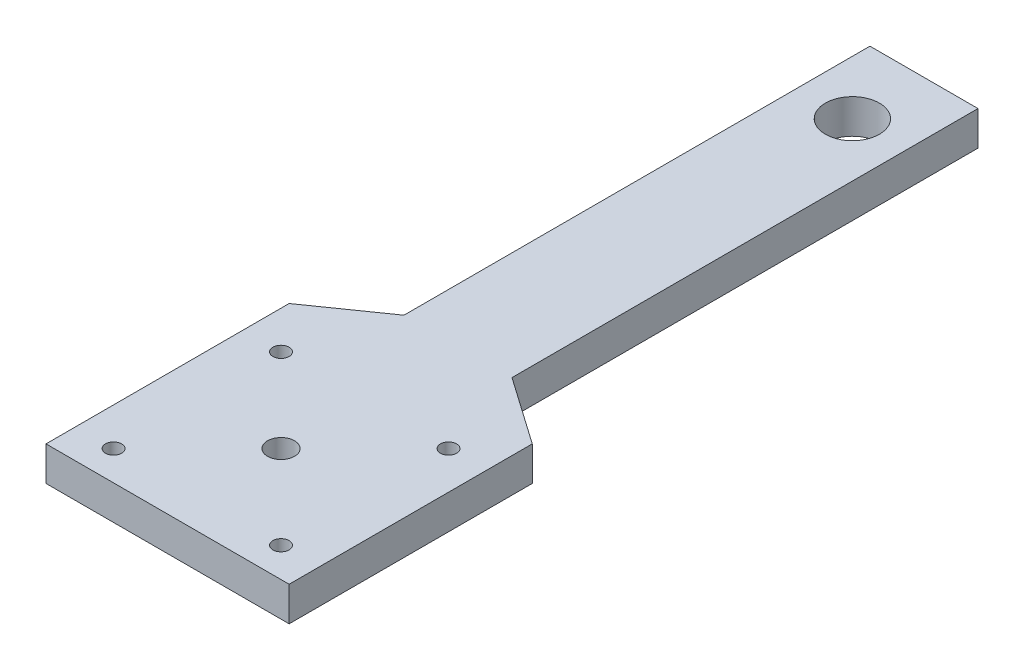
ISO-10303-21;
HEADER;
FILE_DESCRIPTION(('STEP AP214'),'2;1');
FILE_NAME('part.step','',(''),(''),'','','');
FILE_SCHEMA(('AUTOMOTIVE_DESIGN { 1 0 10303 214 1 1 1 1 }'));
ENDSEC;
DATA;
#1=APPLICATION_CONTEXT('core data for automotive mechanical design processes');
#2=APPLICATION_PROTOCOL_DEFINITION('international standard','automotive_design',2000,#1);
#3=PRODUCT_CONTEXT('',#1,'mechanical');
#4=PRODUCT('Part','Part','',(#3));
#5=PRODUCT_RELATED_PRODUCT_CATEGORY('part','',(#4));
#6=PRODUCT_DEFINITION_FORMATION('','',#4);
#7=PRODUCT_DEFINITION_CONTEXT('part definition',#1,'design');
#8=PRODUCT_DEFINITION('design','',#6,#7);
#9=PRODUCT_DEFINITION_SHAPE('','',#8);
#10=(LENGTH_UNIT() NAMED_UNIT(*) SI_UNIT(.MILLI.,.METRE.));
#11=(NAMED_UNIT(*) PLANE_ANGLE_UNIT() SI_UNIT($,.RADIAN.));
#12=(NAMED_UNIT(*) SI_UNIT($,.STERADIAN.) SOLID_ANGLE_UNIT());
#13=UNCERTAINTY_MEASURE_WITH_UNIT(LENGTH_MEASURE(1.E-05),#10,'distance_accuracy_value','');
#14=(GEOMETRIC_REPRESENTATION_CONTEXT(3) GLOBAL_UNCERTAINTY_ASSIGNED_CONTEXT((#13)) GLOBAL_UNIT_ASSIGNED_CONTEXT((#10,
#11,#12)) REPRESENTATION_CONTEXT('',''));
#15=CARTESIAN_POINT('',(0.,0.,0.));
#16=DIRECTION('',(0.,0.,1.));
#17=DIRECTION('',(1.,0.,0.));
#18=AXIS2_PLACEMENT_3D('',#15,#16,#17);
#19=CARTESIAN_POINT('',(0.,6.35,0.));
#20=DIRECTION('',(0.,-1.,0.));
#21=DIRECTION('',(0.,0.,-1.));
#22=AXIS2_PLACEMENT_3D('',#19,#20,#21);
#23=PLANE('',#22);
#24=DIRECTION('',(0.,0.,-1.));
#25=VECTOR('',#24,1.);
#26=CARTESIAN_POINT('',(10.,6.35,9.62240577237863));
#27=LINE('',#26,#25);
#28=CARTESIAN_POINT('',(10.,6.35,9.62240577237863));
#29=VERTEX_POINT('',#28);
#30=CARTESIAN_POINT('',(10.,6.35,-76.625));
#31=VERTEX_POINT('',#30);
#32=EDGE_CURVE('E164',#29,#31,#27,.T.);
#33=ORIENTED_EDGE('',*,*,#32,.T.);
#34=DIRECTION('',(-1.,0.,0.));
#35=VECTOR('',#34,1.);
#36=CARTESIAN_POINT('',(-10.,6.35,-76.625));
#37=LINE('',#36,#35);
#38=CARTESIAN_POINT('',(-10.,6.35,-76.625));
#39=VERTEX_POINT('',#38);
#40=EDGE_CURVE('E100',#31,#39,#37,.T.);
#41=ORIENTED_EDGE('',*,*,#40,.T.);
#42=DIRECTION('',(0.,0.,1.));
#43=VECTOR('',#42,1.);
#44=CARTESIAN_POINT('',(-10.,6.35,9.62240577237863));
#45=LINE('',#44,#43);
#46=CARTESIAN_POINT('',(-10.,6.35,9.62240577237863));
#47=VERTEX_POINT('',#46);
#48=EDGE_CURVE('E185',#39,#47,#45,.T.);
#49=ORIENTED_EDGE('',*,*,#48,.T.);
#50=DIRECTION('',(-0.819152044288991,0.,0.573576436351047));
#51=VECTOR('',#50,1.);
#52=CARTESIAN_POINT('',(-22.5,6.35,18.375));
#53=LINE('',#52,#51);
#54=CARTESIAN_POINT('',(-22.5,6.35,18.375));
#55=VERTEX_POINT('',#54);
#56=EDGE_CURVE('E199',#47,#55,#53,.T.);
#57=ORIENTED_EDGE('',*,*,#56,.T.);
#58=DIRECTION('',(0.,0.,1.));
#59=VECTOR('',#58,1.);
#60=CARTESIAN_POINT('',(-22.5,6.35,63.375));
#61=LINE('',#60,#59);
#62=CARTESIAN_POINT('',(-22.5,6.35,63.375));
#63=VERTEX_POINT('',#62);
#64=EDGE_CURVE('E119',#55,#63,#61,.T.);
#65=ORIENTED_EDGE('',*,*,#64,.T.);
#66=DIRECTION('',(1.,0.,0.));
#67=VECTOR('',#66,1.);
#68=CARTESIAN_POINT('',(0.,6.35,63.375));
#69=LINE('',#68,#67);
#70=CARTESIAN_POINT('',(22.5,6.35,63.375));
#71=VERTEX_POINT('',#70);
#72=EDGE_CURVE('E113',#63,#71,#69,.T.);
#73=ORIENTED_EDGE('',*,*,#72,.T.);
#74=DIRECTION('',(0.,0.,-1.));
#75=VECTOR('',#74,1.);
#76=CARTESIAN_POINT('',(22.5,6.35,63.375));
#77=LINE('',#76,#75);
#78=CARTESIAN_POINT('',(22.5,6.35,18.375));
#79=VERTEX_POINT('',#78);
#80=EDGE_CURVE('E117',#71,#79,#77,.T.);
#81=ORIENTED_EDGE('',*,*,#80,.T.);
#82=DIRECTION('',(-0.819152044288991,0.,-0.573576436351047));
#83=VECTOR('',#82,1.);
#84=CARTESIAN_POINT('',(22.5,6.35,18.375));
#85=LINE('',#84,#83);
#86=EDGE_CURVE('E57',#79,#29,#85,.T.);
#87=ORIENTED_EDGE('',*,*,#86,.T.);
#88=EDGE_LOOP('',(#33,#41,#49,#57,#65,#73,#81,#87));
#89=FACE_BOUND('',#88,.T.);
#90=CARTESIAN_POINT('',(0.,6.35,42.375));
#91=DIRECTION('',(0.,1.,0.));
#92=DIRECTION('',(0.,0.,1.));
#93=AXIS2_PLACEMENT_3D('',#90,#91,#92);
#94=CIRCLE('',#93,2.5);
#95=CARTESIAN_POINT('',(0.,6.35,44.875));
#96=VERTEX_POINT('',#95);
#97=EDGE_CURVE('E145',#96,#96,#94,.T.);
#98=ORIENTED_EDGE('',*,*,#97,.F.);
#99=EDGE_LOOP('',(#98));
#100=FACE_BOUND('',#99,.T.);
#101=CARTESIAN_POINT('',(0.,6.35,-63.375));
#102=DIRECTION('',(0.,1.,0.));
#103=DIRECTION('',(0.,0.,1.));
#104=AXIS2_PLACEMENT_3D('',#101,#102,#103);
#105=CIRCLE('',#104,5.);
#106=CARTESIAN_POINT('',(0.,6.35,-58.375));
#107=VERTEX_POINT('',#106);
#108=EDGE_CURVE('E213',#107,#107,#105,.T.);
#109=ORIENTED_EDGE('',*,*,#108,.F.);
#110=EDGE_LOOP('',(#109));
#111=FACE_BOUND('',#110,.T.);
#112=CARTESIAN_POINT('',(-15.5,6.35,26.875));
#113=DIRECTION('',(0.,1.,0.));
#114=DIRECTION('',(0.,0.,1.));
#115=AXIS2_PLACEMENT_3D('',#112,#113,#114);
#116=CIRCLE('',#115,1.5);
#117=CARTESIAN_POINT('',(-15.5,6.35,28.375));
#118=VERTEX_POINT('',#117);
#119=EDGE_CURVE('E221',#118,#118,#116,.T.);
#120=ORIENTED_EDGE('',*,*,#119,.F.);
#121=EDGE_LOOP('',(#120));
#122=FACE_BOUND('',#121,.T.);
#123=CARTESIAN_POINT('',(15.5,6.35,26.875));
#124=DIRECTION('',(0.,1.,0.));
#125=DIRECTION('',(0.,0.,1.));
#126=AXIS2_PLACEMENT_3D('',#123,#124,#125);
#127=CIRCLE('',#126,1.49999999999999);
#128=CARTESIAN_POINT('',(15.5,6.35,28.375));
#129=VERTEX_POINT('',#128);
#130=EDGE_CURVE('E229',#129,#129,#127,.T.);
#131=ORIENTED_EDGE('',*,*,#130,.F.);
#132=EDGE_LOOP('',(#131));
#133=FACE_BOUND('',#132,.T.);
#134=CARTESIAN_POINT('',(15.5,6.35,57.875));
#135=DIRECTION('',(0.,1.,0.));
#136=DIRECTION('',(0.,0.,1.));
#137=AXIS2_PLACEMENT_3D('',#134,#135,#136);
#138=CIRCLE('',#137,1.5);
#139=CARTESIAN_POINT('',(15.5,6.35,59.375));
#140=VERTEX_POINT('',#139);
#141=EDGE_CURVE('E237',#140,#140,#138,.T.);
#142=ORIENTED_EDGE('',*,*,#141,.F.);
#143=EDGE_LOOP('',(#142));
#144=FACE_BOUND('',#143,.T.);
#145=CARTESIAN_POINT('',(-15.5,6.35,57.875));
#146=DIRECTION('',(0.,1.,0.));
#147=DIRECTION('',(0.,0.,1.));
#148=AXIS2_PLACEMENT_3D('',#145,#146,#147);
#149=CIRCLE('',#148,1.5);
#150=CARTESIAN_POINT('',(-15.5,6.35,59.375));
#151=VERTEX_POINT('',#150);
#152=EDGE_CURVE('E245',#151,#151,#149,.T.);
#153=ORIENTED_EDGE('',*,*,#152,.F.);
#154=EDGE_LOOP('',(#153));
#155=FACE_BOUND('',#154,.T.);
#156=ADVANCED_FACE('F39',(#89,#100,#111,#122,#133,#144,#155),#23,.F.);
#157=CARTESIAN_POINT('',(0.,0.,0.));
#158=DIRECTION('',(0.,-1.,0.));
#159=DIRECTION('',(0.,0.,-1.));
#160=AXIS2_PLACEMENT_3D('',#157,#158,#159);
#161=PLANE('',#160);
#162=CARTESIAN_POINT('',(15.5,0.,57.875));
#163=DIRECTION('',(0.,1.,0.));
#164=DIRECTION('',(0.,0.,1.));
#165=AXIS2_PLACEMENT_3D('',#162,#163,#164);
#166=CIRCLE('',#165,1.5);
#167=CARTESIAN_POINT('',(15.5,0.,59.375));
#168=VERTEX_POINT('',#167);
#169=EDGE_CURVE('E241',#168,#168,#166,.T.);
#170=ORIENTED_EDGE('',*,*,#169,.T.);
#171=EDGE_LOOP('',(#170));
#172=FACE_BOUND('',#171,.T.);
#173=CARTESIAN_POINT('',(-15.5,0.,26.875));
#174=DIRECTION('',(0.,1.,0.));
#175=DIRECTION('',(0.,0.,1.));
#176=AXIS2_PLACEMENT_3D('',#173,#174,#175);
#177=CIRCLE('',#176,1.5);
#178=CARTESIAN_POINT('',(-15.5,0.,28.375));
#179=VERTEX_POINT('',#178);
#180=EDGE_CURVE('E225',#179,#179,#177,.T.);
#181=ORIENTED_EDGE('',*,*,#180,.T.);
#182=EDGE_LOOP('',(#181));
#183=FACE_BOUND('',#182,.T.);
#184=CARTESIAN_POINT('',(0.,0.,42.375));
#185=DIRECTION('',(0.,1.,0.));
#186=DIRECTION('',(0.,0.,1.));
#187=AXIS2_PLACEMENT_3D('',#184,#185,#186);
#188=CIRCLE('',#187,2.5);
#189=CARTESIAN_POINT('',(0.,0.,44.875));
#190=VERTEX_POINT('',#189);
#191=EDGE_CURVE('E209',#190,#190,#188,.T.);
#192=ORIENTED_EDGE('',*,*,#191,.T.);
#193=EDGE_LOOP('',(#192));
#194=FACE_BOUND('',#193,.T.);
#195=DIRECTION('',(0.,0.,-1.));
#196=VECTOR('',#195,1.);
#197=CARTESIAN_POINT('',(10.,0.,9.62240577237863));
#198=LINE('',#197,#196);
#199=CARTESIAN_POINT('',(10.,0.,9.62240577237863));
#200=VERTEX_POINT('',#199);
#201=CARTESIAN_POINT('',(10.,0.,-76.625));
#202=VERTEX_POINT('',#201);
#203=EDGE_CURVE('E140',#200,#202,#198,.T.);
#204=ORIENTED_EDGE('',*,*,#203,.F.);
#205=DIRECTION('',(-0.819152044288991,0.,-0.573576436351047));
#206=VECTOR('',#205,1.);
#207=CARTESIAN_POINT('',(22.5,0.,18.375));
#208=LINE('',#207,#206);
#209=CARTESIAN_POINT('',(22.5,0.,18.375));
#210=VERTEX_POINT('',#209);
#211=EDGE_CURVE('E92',#210,#200,#208,.T.);
#212=ORIENTED_EDGE('',*,*,#211,.F.);
#213=DIRECTION('',(0.,0.,-1.));
#214=VECTOR('',#213,1.);
#215=CARTESIAN_POINT('',(22.5,0.,63.375));
#216=LINE('',#215,#214);
#217=CARTESIAN_POINT('',(22.5,0.,63.375));
#218=VERTEX_POINT('',#217);
#219=EDGE_CURVE('E86',#218,#210,#216,.T.);
#220=ORIENTED_EDGE('',*,*,#219,.F.);
#221=DIRECTION('',(1.,0.,0.));
#222=VECTOR('',#221,1.);
#223=CARTESIAN_POINT('',(0.,0.,63.375));
#224=LINE('',#223,#222);
#225=CARTESIAN_POINT('',(-22.5,0.,63.375));
#226=VERTEX_POINT('',#225);
#227=EDGE_CURVE('E127',#226,#218,#224,.T.);
#228=ORIENTED_EDGE('',*,*,#227,.F.);
#229=DIRECTION('',(0.,0.,1.));
#230=VECTOR('',#229,1.);
#231=CARTESIAN_POINT('',(-22.5,0.,63.375));
#232=LINE('',#231,#230);
#233=CARTESIAN_POINT('',(-22.5,0.,18.375));
#234=VERTEX_POINT('',#233);
#235=EDGE_CURVE('E154',#234,#226,#232,.T.);
#236=ORIENTED_EDGE('',*,*,#235,.F.);
#237=DIRECTION('',(-0.819152044288991,0.,0.573576436351047));
#238=VECTOR('',#237,1.);
#239=CARTESIAN_POINT('',(-22.5,0.,18.375));
#240=LINE('',#239,#238);
#241=CARTESIAN_POINT('',(-10.,0.,9.62240577237863));
#242=VERTEX_POINT('',#241);
#243=EDGE_CURVE('E151',#242,#234,#240,.T.);
#244=ORIENTED_EDGE('',*,*,#243,.F.);
#245=DIRECTION('',(0.,0.,1.));
#246=VECTOR('',#245,1.);
#247=CARTESIAN_POINT('',(-10.,0.,9.62240577237863));
#248=LINE('',#247,#246);
#249=CARTESIAN_POINT('',(-10.,0.,-76.625));
#250=VERTEX_POINT('',#249);
#251=EDGE_CURVE('E148',#250,#242,#248,.T.);
#252=ORIENTED_EDGE('',*,*,#251,.F.);
#253=DIRECTION('',(-1.,0.,0.));
#254=VECTOR('',#253,1.);
#255=CARTESIAN_POINT('',(-10.,0.,-76.625));
#256=LINE('',#255,#254);
#257=EDGE_CURVE('E144',#202,#250,#256,.T.);
#258=ORIENTED_EDGE('',*,*,#257,.F.);
#259=EDGE_LOOP('',(#204,#212,#220,#228,#236,#244,#252,#258));
#260=FACE_BOUND('',#259,.T.);
#261=CARTESIAN_POINT('',(0.,0.,-63.375));
#262=DIRECTION('',(0.,1.,0.));
#263=DIRECTION('',(0.,0.,1.));
#264=AXIS2_PLACEMENT_3D('',#261,#262,#263);
#265=CIRCLE('',#264,5.);
#266=CARTESIAN_POINT('',(0.,0.,-58.375));
#267=VERTEX_POINT('',#266);
#268=EDGE_CURVE('E217',#267,#267,#265,.T.);
#269=ORIENTED_EDGE('',*,*,#268,.T.);
#270=EDGE_LOOP('',(#269));
#271=FACE_BOUND('',#270,.T.);
#272=CARTESIAN_POINT('',(15.5,0.,26.875));
#273=DIRECTION('',(0.,1.,0.));
#274=DIRECTION('',(0.,0.,1.));
#275=AXIS2_PLACEMENT_3D('',#272,#273,#274);
#276=CIRCLE('',#275,1.49999999999999);
#277=CARTESIAN_POINT('',(15.5,0.,28.375));
#278=VERTEX_POINT('',#277);
#279=EDGE_CURVE('E233',#278,#278,#276,.T.);
#280=ORIENTED_EDGE('',*,*,#279,.T.);
#281=EDGE_LOOP('',(#280));
#282=FACE_BOUND('',#281,.T.);
#283=CARTESIAN_POINT('',(-15.5,0.,57.875));
#284=DIRECTION('',(0.,1.,0.));
#285=DIRECTION('',(0.,0.,1.));
#286=AXIS2_PLACEMENT_3D('',#283,#284,#285);
#287=CIRCLE('',#286,1.5);
#288=CARTESIAN_POINT('',(-15.5,0.,59.375));
#289=VERTEX_POINT('',#288);
#290=EDGE_CURVE('E249',#289,#289,#287,.T.);
#291=ORIENTED_EDGE('',*,*,#290,.T.);
#292=EDGE_LOOP('',(#291));
#293=FACE_BOUND('',#292,.T.);
#294=ADVANCED_FACE('F189',(#172,#183,#194,#260,#271,#282,#293),#161,.T.);
#295=CARTESIAN_POINT('',(10.,6.35,9.62240577237863));
#296=DIRECTION('',(-1.,0.,0.));
#297=DIRECTION('',(0.,0.,1.));
#298=AXIS2_PLACEMENT_3D('',#295,#296,#297);
#299=PLANE('',#298);
#300=ORIENTED_EDGE('',*,*,#203,.T.);
#301=DIRECTION('',(0.,-1.,0.));
#302=VECTOR('',#301,1.);
#303=CARTESIAN_POINT('',(10.,6.35,-76.625));
#304=LINE('',#303,#302);
#305=EDGE_CURVE('E11',#31,#202,#304,.T.);
#306=ORIENTED_EDGE('',*,*,#305,.F.);
#307=ORIENTED_EDGE('',*,*,#32,.F.);
#308=DIRECTION('',(0.,-1.,0.));
#309=VECTOR('',#308,1.);
#310=CARTESIAN_POINT('',(10.,6.35,9.62240577237863));
#311=LINE('',#310,#309);
#312=EDGE_CURVE('E136',#29,#200,#311,.T.);
#313=ORIENTED_EDGE('',*,*,#312,.T.);
#314=EDGE_LOOP('',(#300,#306,#307,#313));
#315=FACE_BOUND('',#314,.T.);
#316=ADVANCED_FACE('F41',(#315),#299,.F.);
#317=CARTESIAN_POINT('',(-10.,6.35,-76.625));
#318=DIRECTION('',(0.,0.,1.));
#319=DIRECTION('',(1.,0.,0.));
#320=AXIS2_PLACEMENT_3D('',#317,#318,#319);
#321=PLANE('',#320);
#322=ORIENTED_EDGE('',*,*,#257,.T.);
#323=DIRECTION('',(0.,-1.,0.));
#324=VECTOR('',#323,1.);
#325=CARTESIAN_POINT('',(-10.,6.35,-76.625));
#326=LINE('',#325,#324);
#327=EDGE_CURVE('E49',#39,#250,#326,.T.);
#328=ORIENTED_EDGE('',*,*,#327,.F.);
#329=ORIENTED_EDGE('',*,*,#40,.F.);
#330=ORIENTED_EDGE('',*,*,#305,.T.);
#331=EDGE_LOOP('',(#322,#328,#329,#330));
#332=FACE_BOUND('',#331,.T.);
#333=ADVANCED_FACE('F283',(#332),#321,.F.);
#334=CARTESIAN_POINT('',(-10.,6.35,9.62240577237863));
#335=DIRECTION('',(1.,0.,0.));
#336=DIRECTION('',(0.,0.,-1.));
#337=AXIS2_PLACEMENT_3D('',#334,#335,#336);
#338=PLANE('',#337);
#339=ORIENTED_EDGE('',*,*,#251,.T.);
#340=DIRECTION('',(0.,-1.,0.));
#341=VECTOR('',#340,1.);
#342=CARTESIAN_POINT('',(-10.,6.35,9.62240577237863));
#343=LINE('',#342,#341);
#344=EDGE_CURVE('E175',#47,#242,#343,.T.);
#345=ORIENTED_EDGE('',*,*,#344,.F.);
#346=ORIENTED_EDGE('',*,*,#48,.F.);
#347=ORIENTED_EDGE('',*,*,#327,.T.);
#348=EDGE_LOOP('',(#339,#345,#346,#347));
#349=FACE_BOUND('',#348,.T.);
#350=ADVANCED_FACE('F183',(#349),#338,.F.);
#351=CARTESIAN_POINT('',(-22.5,6.35,18.375));
#352=DIRECTION('',(0.573576436351047,0.,0.819152044288991));
#353=DIRECTION('',(0.819152044288991,0.,-0.573576436351047));
#354=AXIS2_PLACEMENT_3D('',#351,#352,#353);
#355=PLANE('',#354);
#356=ORIENTED_EDGE('',*,*,#243,.T.);
#357=DIRECTION('',(0.,-1.,0.));
#358=VECTOR('',#357,1.);
#359=CARTESIAN_POINT('',(-22.5,6.35,18.375));
#360=LINE('',#359,#358);
#361=EDGE_CURVE('E171',#55,#234,#360,.T.);
#362=ORIENTED_EDGE('',*,*,#361,.F.);
#363=ORIENTED_EDGE('',*,*,#56,.F.);
#364=ORIENTED_EDGE('',*,*,#344,.T.);
#365=EDGE_LOOP('',(#356,#362,#363,#364));
#366=FACE_BOUND('',#365,.T.);
#367=ADVANCED_FACE('F194',(#366),#355,.F.);
#368=CARTESIAN_POINT('',(-22.5,6.35,63.375));
#369=DIRECTION('',(1.,0.,0.));
#370=DIRECTION('',(0.,0.,-1.));
#371=AXIS2_PLACEMENT_3D('',#368,#369,#370);
#372=PLANE('',#371);
#373=ORIENTED_EDGE('',*,*,#235,.T.);
#374=DIRECTION('',(0.,-1.,0.));
#375=VECTOR('',#374,1.);
#376=CARTESIAN_POINT('',(-22.5,6.35,63.375));
#377=LINE('',#376,#375);
#378=EDGE_CURVE('E129',#63,#226,#377,.T.);
#379=ORIENTED_EDGE('',*,*,#378,.F.);
#380=ORIENTED_EDGE('',*,*,#64,.F.);
#381=ORIENTED_EDGE('',*,*,#361,.T.);
#382=EDGE_LOOP('',(#373,#379,#380,#381));
#383=FACE_BOUND('',#382,.T.);
#384=ADVANCED_FACE('F197',(#383),#372,.F.);
#385=CARTESIAN_POINT('',(0.,6.35,63.375));
#386=DIRECTION('',(0.,0.,-1.));
#387=DIRECTION('',(-1.,0.,0.));
#388=AXIS2_PLACEMENT_3D('',#385,#386,#387);
#389=PLANE('',#388);
#390=ORIENTED_EDGE('',*,*,#227,.T.);
#391=DIRECTION('',(0.,-1.,0.));
#392=VECTOR('',#391,1.);
#393=CARTESIAN_POINT('',(22.5,6.35,63.375));
#394=LINE('',#393,#392);
#395=EDGE_CURVE('E125',#71,#218,#394,.T.);
#396=ORIENTED_EDGE('',*,*,#395,.F.);
#397=ORIENTED_EDGE('',*,*,#72,.F.);
#398=ORIENTED_EDGE('',*,*,#378,.T.);
#399=EDGE_LOOP('',(#390,#396,#397,#398));
#400=FACE_BOUND('',#399,.T.);
#401=ADVANCED_FACE('F126',(#400),#389,.F.);
#402=CARTESIAN_POINT('',(22.5,6.35,63.375));
#403=DIRECTION('',(-1.,0.,0.));
#404=DIRECTION('',(0.,0.,1.));
#405=AXIS2_PLACEMENT_3D('',#402,#403,#404);
#406=PLANE('',#405);
#407=ORIENTED_EDGE('',*,*,#219,.T.);
#408=DIRECTION('',(0.,-1.,0.));
#409=VECTOR('',#408,1.);
#410=CARTESIAN_POINT('',(22.5,6.35,18.375));
#411=LINE('',#410,#409);
#412=EDGE_CURVE('E130',#79,#210,#411,.T.);
#413=ORIENTED_EDGE('',*,*,#412,.F.);
#414=ORIENTED_EDGE('',*,*,#80,.F.);
#415=ORIENTED_EDGE('',*,*,#395,.T.);
#416=EDGE_LOOP('',(#407,#413,#414,#415));
#417=FACE_BOUND('',#416,.T.);
#418=ADVANCED_FACE('F132',(#417),#406,.F.);
#419=CARTESIAN_POINT('',(22.5,6.35,18.375));
#420=DIRECTION('',(-0.573576436351047,0.,0.819152044288991));
#421=DIRECTION('',(0.819152044288991,0.,0.573576436351047));
#422=AXIS2_PLACEMENT_3D('',#419,#420,#421);
#423=PLANE('',#422);
#424=ORIENTED_EDGE('',*,*,#211,.T.);
#425=ORIENTED_EDGE('',*,*,#312,.F.);
#426=ORIENTED_EDGE('',*,*,#86,.F.);
#427=ORIENTED_EDGE('',*,*,#412,.T.);
#428=EDGE_LOOP('',(#424,#425,#426,#427));
#429=FACE_BOUND('',#428,.T.);
#430=ADVANCED_FACE('F271',(#429),#423,.F.);
#431=CARTESIAN_POINT('',(0.,6.35,42.375));
#432=DIRECTION('',(0.,-1.,0.));
#433=DIRECTION('',(0.,0.,-1.));
#434=AXIS2_PLACEMENT_3D('',#431,#432,#433);
#435=CYLINDRICAL_SURFACE('',#434,2.5);
#436=ORIENTED_EDGE('',*,*,#97,.T.);
#437=EDGE_LOOP('',(#436));
#438=FACE_BOUND('',#437,.T.);
#439=ORIENTED_EDGE('',*,*,#191,.F.);
#440=EDGE_LOOP('',(#439));
#441=FACE_BOUND('',#440,.T.);
#442=ADVANCED_FACE('F268',(#438,#441),#435,.F.);
#443=CARTESIAN_POINT('',(0.,6.35,-63.375));
#444=DIRECTION('',(0.,-1.,0.));
#445=DIRECTION('',(0.,0.,-1.));
#446=AXIS2_PLACEMENT_3D('',#443,#444,#445);
#447=CYLINDRICAL_SURFACE('',#446,5.);
#448=ORIENTED_EDGE('',*,*,#108,.T.);
#449=EDGE_LOOP('',(#448));
#450=FACE_BOUND('',#449,.T.);
#451=ORIENTED_EDGE('',*,*,#268,.F.);
#452=EDGE_LOOP('',(#451));
#453=FACE_BOUND('',#452,.T.);
#454=ADVANCED_FACE('F350',(#450,#453),#447,.F.);
#455=CARTESIAN_POINT('',(-15.5,6.35,26.875));
#456=DIRECTION('',(0.,-1.,0.));
#457=DIRECTION('',(0.,0.,-1.));
#458=AXIS2_PLACEMENT_3D('',#455,#456,#457);
#459=CYLINDRICAL_SURFACE('',#458,1.5);
#460=ORIENTED_EDGE('',*,*,#119,.T.);
#461=EDGE_LOOP('',(#460));
#462=FACE_BOUND('',#461,.T.);
#463=ORIENTED_EDGE('',*,*,#180,.F.);
#464=EDGE_LOOP('',(#463));
#465=FACE_BOUND('',#464,.T.);
#466=ADVANCED_FACE('F358',(#462,#465),#459,.F.);
#467=CARTESIAN_POINT('',(15.5,6.35,26.875));
#468=DIRECTION('',(0.,-1.,0.));
#469=DIRECTION('',(0.,0.,-1.));
#470=AXIS2_PLACEMENT_3D('',#467,#468,#469);
#471=CYLINDRICAL_SURFACE('',#470,1.49999999999999);
#472=ORIENTED_EDGE('',*,*,#130,.T.);
#473=EDGE_LOOP('',(#472));
#474=FACE_BOUND('',#473,.T.);
#475=ORIENTED_EDGE('',*,*,#279,.F.);
#476=EDGE_LOOP('',(#475));
#477=FACE_BOUND('',#476,.T.);
#478=ADVANCED_FACE('F366',(#474,#477),#471,.F.);
#479=CARTESIAN_POINT('',(15.5,6.35,57.875));
#480=DIRECTION('',(0.,-1.,0.));
#481=DIRECTION('',(0.,0.,-1.));
#482=AXIS2_PLACEMENT_3D('',#479,#480,#481);
#483=CYLINDRICAL_SURFACE('',#482,1.5);
#484=ORIENTED_EDGE('',*,*,#141,.T.);
#485=EDGE_LOOP('',(#484));
#486=FACE_BOUND('',#485,.T.);
#487=ORIENTED_EDGE('',*,*,#169,.F.);
#488=EDGE_LOOP('',(#487));
#489=FACE_BOUND('',#488,.T.);
#490=ADVANCED_FACE('F375',(#486,#489),#483,.F.);
#491=CARTESIAN_POINT('',(-15.5,6.35,57.875));
#492=DIRECTION('',(0.,-1.,0.));
#493=DIRECTION('',(0.,0.,-1.));
#494=AXIS2_PLACEMENT_3D('',#491,#492,#493);
#495=CYLINDRICAL_SURFACE('',#494,1.5);
#496=ORIENTED_EDGE('',*,*,#152,.T.);
#497=EDGE_LOOP('',(#496));
#498=FACE_BOUND('',#497,.T.);
#499=ORIENTED_EDGE('',*,*,#290,.F.);
#500=EDGE_LOOP('',(#499));
#501=FACE_BOUND('',#500,.T.);
#502=ADVANCED_FACE('F257',(#498,#501),#495,.F.);
#503=CLOSED_SHELL('',(#156,#294,#316,#333,#350,#367,#384,#401,#418,#430,#442,#454,#466,#478,
#490,#502));
#504=MANIFOLD_SOLID_BREP('B2',#503);
#505=ADVANCED_BREP_SHAPE_REPRESENTATION('',(#18,#504),#14);
#506=SHAPE_DEFINITION_REPRESENTATION(#9,#505);
ENDSEC;
END-ISO-10303-21;
